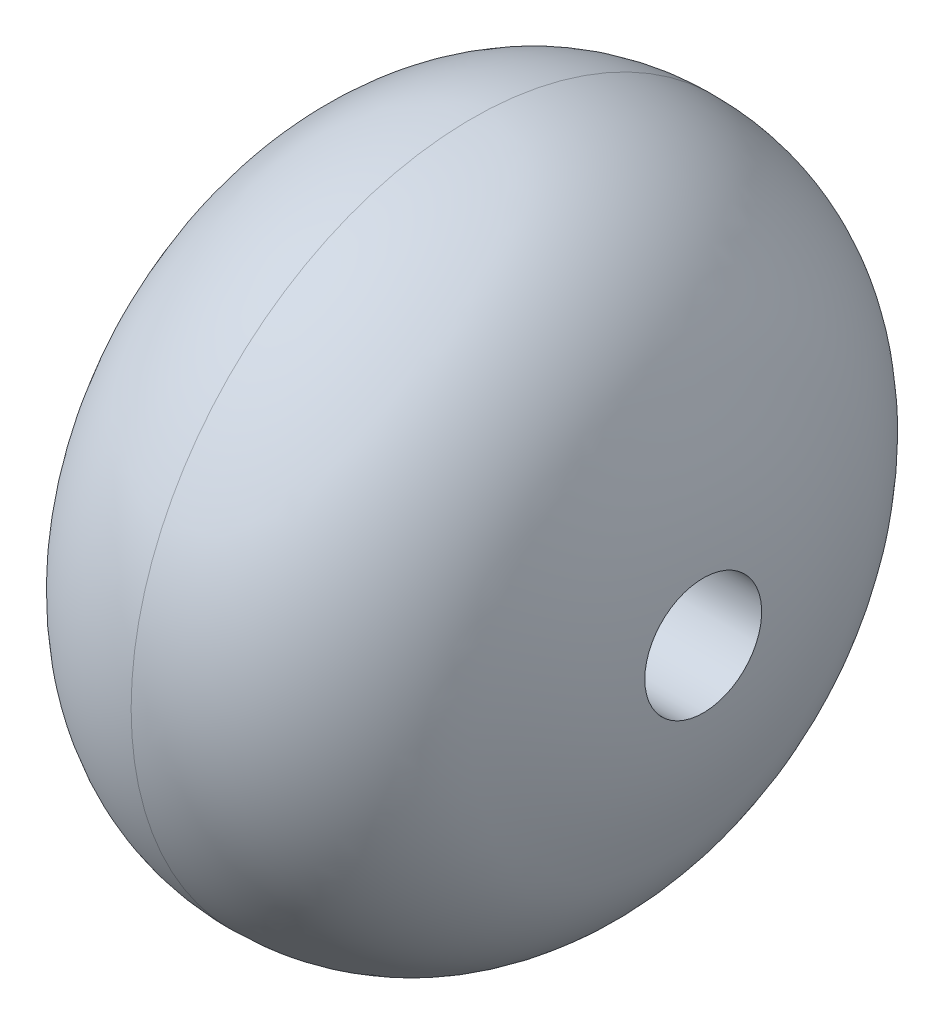
ISO-10303-21;
HEADER;
FILE_DESCRIPTION(('STEP AP214'),'2;1');
FILE_NAME('part.step','',(''),(''),'','','');
FILE_SCHEMA(('AUTOMOTIVE_DESIGN { 1 0 10303 214 1 1 1 1 }'));
ENDSEC;
DATA;
#1=APPLICATION_CONTEXT('core data for automotive mechanical design processes');
#2=APPLICATION_PROTOCOL_DEFINITION('international standard','automotive_design',2000,#1);
#3=PRODUCT_CONTEXT('',#1,'mechanical');
#4=PRODUCT('Part','Part','',(#3));
#5=PRODUCT_RELATED_PRODUCT_CATEGORY('part','',(#4));
#6=PRODUCT_DEFINITION_FORMATION('','',#4);
#7=PRODUCT_DEFINITION_CONTEXT('part definition',#1,'design');
#8=PRODUCT_DEFINITION('design','',#6,#7);
#9=PRODUCT_DEFINITION_SHAPE('','',#8);
#10=(LENGTH_UNIT() NAMED_UNIT(*) SI_UNIT(.MILLI.,.METRE.));
#11=(NAMED_UNIT(*) PLANE_ANGLE_UNIT() SI_UNIT($,.RADIAN.));
#12=(NAMED_UNIT(*) SI_UNIT($,.STERADIAN.) SOLID_ANGLE_UNIT());
#13=UNCERTAINTY_MEASURE_WITH_UNIT(LENGTH_MEASURE(1.E-05),#10,'distance_accuracy_value','');
#14=(GEOMETRIC_REPRESENTATION_CONTEXT(3) GLOBAL_UNCERTAINTY_ASSIGNED_CONTEXT((#13)) GLOBAL_UNIT_ASSIGNED_CONTEXT((#10,
#11,#12)) REPRESENTATION_CONTEXT('',''));
#15=CARTESIAN_POINT('',(0.,0.,0.));
#16=DIRECTION('',(0.,0.,1.));
#17=DIRECTION('',(1.,0.,0.));
#18=AXIS2_PLACEMENT_3D('',#15,#16,#17);
#19=CARTESIAN_POINT('',(0.,17.5,0.));
#20=CARTESIAN_POINT('',(-5.0561882578458,17.5,0.));
#21=CARTESIAN_POINT('',(-8.82049388318443,13.5262578039967,0.));
#22=CARTESIAN_POINT('',(-11.1655868652791,7.44920817203737,0.));
#23=CARTESIAN_POINT('',(-12.,4.39117743451791,0.));
#24=CARTESIAN_POINT('',(-12.,0.,0.));
#25=B_SPLINE_CURVE_WITH_KNOTS('',3,(#19,#20,#21,#22,#23,#24),.UNSPECIFIED.,.F.,.F.,(4,1,1,4),
(0.,0.426295671695431,0.526295671695431,1.),.UNSPECIFIED.);
#26=CARTESIAN_POINT('',(-12.,0.,0.));
#27=DIRECTION('',(-1.,0.,0.));
#28=AXIS1_PLACEMENT('',#26,#27);
#29=SURFACE_OF_REVOLUTION('',#25,#28);
#30=CARTESIAN_POINT('',(-11.8740791040957,0.,0.));
#31=DIRECTION('',(-1.,0.,0.));
#32=DIRECTION('',(0.,0.,1.));
#33=AXIS2_PLACEMENT_3D('',#30,#31,#32);
#34=CIRCLE('',#33,3.);
#35=CARTESIAN_POINT('',(-11.8740791040957,0.,3.));
#36=VERTEX_POINT('',#35);
#37=EDGE_CURVE('E53',#36,#36,#34,.F.);
#38=ORIENTED_EDGE('',*,*,#37,.T.);
#39=EDGE_LOOP('',(#38));
#40=FACE_BOUND('',#39,.T.);
#41=CARTESIAN_POINT('',(0.,0.,0.));
#42=DIRECTION('',(-1.,0.,0.));
#43=DIRECTION('',(0.,0.,1.));
#44=AXIS2_PLACEMENT_3D('',#41,#42,#43);
#45=CIRCLE('',#44,17.5);
#46=CARTESIAN_POINT('',(0.,0.,17.5));
#47=VERTEX_POINT('',#46);
#48=EDGE_CURVE('E12',#47,#47,#45,.T.);
#49=ORIENTED_EDGE('',*,*,#48,.T.);
#50=EDGE_LOOP('',(#49));
#51=FACE_BOUND('',#50,.T.);
#52=ADVANCED_FACE('F45',(#40,#51),#29,.T.);
#53=CARTESIAN_POINT('',(12.,0.,0.));
#54=CARTESIAN_POINT('',(12.,4.39117743451791,0.));
#55=CARTESIAN_POINT('',(11.1655868652791,7.44920817203737,0.));
#56=CARTESIAN_POINT('',(8.82049388318443,13.5262578039967,0.));
#57=CARTESIAN_POINT('',(5.0561882578458,17.5,0.));
#58=CARTESIAN_POINT('',(0.,17.5,0.));
#59=B_SPLINE_CURVE_WITH_KNOTS('',3,(#53,#54,#55,#56,#57,#58),.UNSPECIFIED.,.F.,.F.,(4,1,1,4),
(0.,0.473704328304569,0.573704328304569,1.),.UNSPECIFIED.);
#60=CARTESIAN_POINT('',(-12.,0.,0.));
#61=DIRECTION('',(-1.,0.,0.));
#62=AXIS1_PLACEMENT('',#60,#61);
#63=SURFACE_OF_REVOLUTION('',#59,#62);
#64=CARTESIAN_POINT('',(11.8740791040957,0.,0.));
#65=DIRECTION('',(-1.,0.,0.));
#66=DIRECTION('',(0.,0.,1.));
#67=AXIS2_PLACEMENT_3D('',#64,#65,#66);
#68=CIRCLE('',#67,3.);
#69=CARTESIAN_POINT('',(11.8740791040957,0.,3.));
#70=VERTEX_POINT('',#69);
#71=EDGE_CURVE('E49',#70,#70,#68,.T.);
#72=ORIENTED_EDGE('',*,*,#71,.T.);
#73=EDGE_LOOP('',(#72));
#74=FACE_BOUND('',#73,.T.);
#75=ORIENTED_EDGE('',*,*,#48,.F.);
#76=EDGE_LOOP('',(#75));
#77=FACE_BOUND('',#76,.T.);
#78=ADVANCED_FACE('F68',(#74,#77),#63,.T.);
#79=CARTESIAN_POINT('',(-12.,0.,0.));
#80=DIRECTION('',(1.,0.,0.));
#81=DIRECTION('',(0.,0.,-1.));
#82=AXIS2_PLACEMENT_3D('',#79,#80,#81);
#83=CYLINDRICAL_SURFACE('',#82,3.);
#84=ORIENTED_EDGE('',*,*,#71,.F.);
#85=EDGE_LOOP('',(#84));
#86=FACE_BOUND('',#85,.T.);
#87=ORIENTED_EDGE('',*,*,#37,.F.);
#88=EDGE_LOOP('',(#87));
#89=FACE_BOUND('',#88,.T.);
#90=ADVANCED_FACE('F71',(#86,#89),#83,.F.);
#91=CLOSED_SHELL('',(#52,#78,#90));
#92=MANIFOLD_SOLID_BREP('B2',#91);
#93=ADVANCED_BREP_SHAPE_REPRESENTATION('',(#18,#92),#14);
#94=SHAPE_DEFINITION_REPRESENTATION(#9,#93);
ENDSEC;
END-ISO-10303-21;
